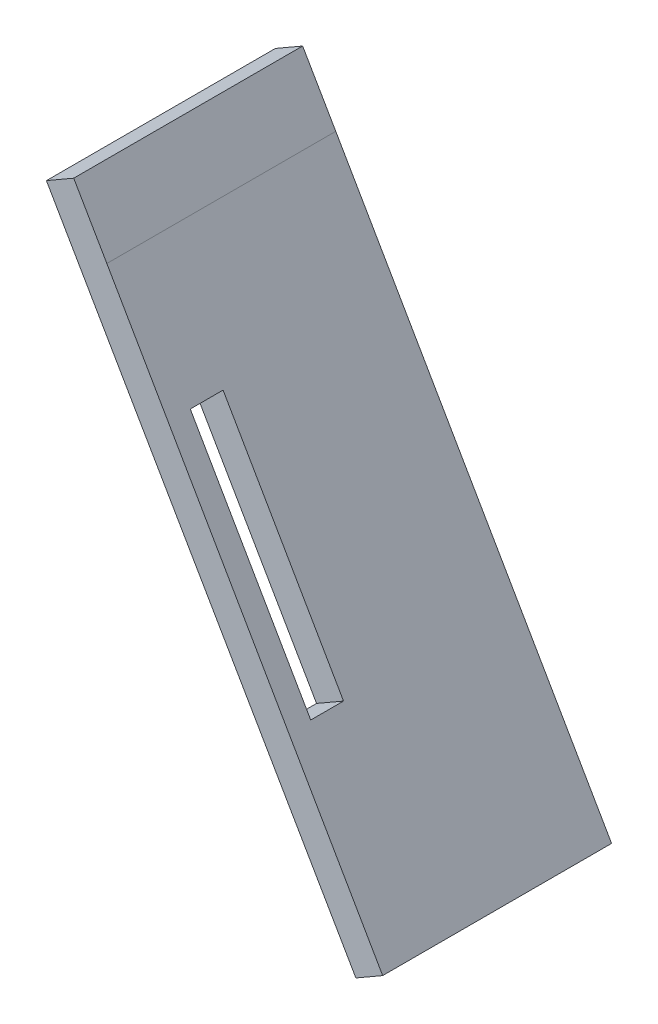
ISO-10303-21;
HEADER;
FILE_DESCRIPTION(('STEP AP214'),'2;1');
FILE_NAME('part.step','',(''),(''),'','','');
FILE_SCHEMA(('AUTOMOTIVE_DESIGN { 1 0 10303 214 1 1 1 1 }'));
ENDSEC;
DATA;
#1=APPLICATION_CONTEXT('core data for automotive mechanical design processes');
#2=APPLICATION_PROTOCOL_DEFINITION('international standard','automotive_design',2000,#1);
#3=PRODUCT_CONTEXT('',#1,'mechanical');
#4=PRODUCT('Part','Part','',(#3));
#5=PRODUCT_RELATED_PRODUCT_CATEGORY('part','',(#4));
#6=PRODUCT_DEFINITION_FORMATION('','',#4);
#7=PRODUCT_DEFINITION_CONTEXT('part definition',#1,'design');
#8=PRODUCT_DEFINITION('design','',#6,#7);
#9=PRODUCT_DEFINITION_SHAPE('','',#8);
#10=(LENGTH_UNIT() NAMED_UNIT(*) SI_UNIT(.MILLI.,.METRE.));
#11=(NAMED_UNIT(*) PLANE_ANGLE_UNIT() SI_UNIT($,.RADIAN.));
#12=(NAMED_UNIT(*) SI_UNIT($,.STERADIAN.) SOLID_ANGLE_UNIT());
#13=UNCERTAINTY_MEASURE_WITH_UNIT(LENGTH_MEASURE(1.E-05),#10,'distance_accuracy_value','');
#14=(GEOMETRIC_REPRESENTATION_CONTEXT(3) GLOBAL_UNCERTAINTY_ASSIGNED_CONTEXT((#13)) GLOBAL_UNIT_ASSIGNED_CONTEXT((#10,
#11,#12)) REPRESENTATION_CONTEXT('',''));
#15=CARTESIAN_POINT('',(0.,0.,0.));
#16=DIRECTION('',(0.,0.,1.));
#17=DIRECTION('',(1.,0.,0.));
#18=AXIS2_PLACEMENT_3D('',#15,#16,#17);
#19=CARTESIAN_POINT('',(0.,0.,0.));
#20=DIRECTION('',(0.,0.,1.));
#21=DIRECTION('',(1.,0.,0.));
#22=AXIS2_PLACEMENT_3D('',#19,#20,#21);
#23=PLANE('',#22);
#24=DIRECTION('',(-0.500301119905299,0.865851482311778,0.));
#25=VECTOR('',#24,1.);
#26=CARTESIAN_POINT('',(54.4126209077468,89.1522145456013,0.));
#27=LINE('',#26,#25);
#28=CARTESIAN_POINT('',(59.7662860214186,79.8868367760072,0.));
#29=VERTEX_POINT('',#28);
#30=CARTESIAN_POINT('',(54.4126209077468,89.1522145456013,0.));
#31=VERTEX_POINT('',#30);
#32=EDGE_CURVE('E135',#29,#31,#27,.T.);
#33=ORIENTED_EDGE('',*,*,#32,.F.);
#34=DIRECTION('',(-0.499180722761635,0.86649789729876,0.));
#35=VECTOR('',#34,1.);
#36=CARTESIAN_POINT('',(104.34763037884,2.50075317336757,0.));
#37=LINE('',#36,#35);
#38=CARTESIAN_POINT('',(104.34763037884,2.50075317336757,0.));
#39=VERTEX_POINT('',#38);
#40=EDGE_CURVE('E169',#39,#29,#37,.T.);
#41=ORIENTED_EDGE('',*,*,#40,.F.);
#42=DIRECTION('',(0.865938417345993,0.500150634673513,0.));
#43=VECTOR('',#42,1.);
#44=CARTESIAN_POINT('',(100.017938292111,0.,0.));
#45=LINE('',#44,#43);
#46=CARTESIAN_POINT('',(100.017938292111,0.,0.));
#47=VERTEX_POINT('',#46);
#48=EDGE_CURVE('E166',#47,#39,#45,.T.);
#49=ORIENTED_EDGE('',*,*,#48,.F.);
#50=DIRECTION('',(0.500150634673512,-0.865938417345993,0.));
#51=VECTOR('',#50,1.);
#52=CARTESIAN_POINT('',(55.3500000472887,77.3360685127968,0.));
#53=LINE('',#52,#51);
#54=CARTESIAN_POINT('',(55.3500000472887,77.3360685127968,0.));
#55=VERTEX_POINT('',#54);
#56=EDGE_CURVE('E163',#55,#47,#53,.T.);
#57=ORIENTED_EDGE('',*,*,#56,.F.);
#58=DIRECTION('',(0.500000000000109,-0.866025403784375,0.));
#59=VECTOR('',#58,1.);
#60=CARTESIAN_POINT('',(50.0000000283191,86.6025403661439,0.));
#61=LINE('',#60,#59);
#62=CARTESIAN_POINT('',(50.0000000283191,86.6025403661439,0.));
#63=VERTEX_POINT('',#62);
#64=EDGE_CURVE('E160',#63,#55,#61,.T.);
#65=ORIENTED_EDGE('',*,*,#64,.F.);
#66=DIRECTION('',(-0.865851482311778,-0.500301119905299,0.));
#67=VECTOR('',#66,1.);
#68=CARTESIAN_POINT('',(50.0000000283191,86.6025403661439,0.));
#69=LINE('',#68,#67);
#70=EDGE_CURVE('E157',#31,#63,#69,.T.);
#71=ORIENTED_EDGE('',*,*,#70,.F.);
#72=EDGE_LOOP('',(#33,#41,#49,#57,#65,#71));
#73=FACE_BOUND('',#72,.T.);
#74=ADVANCED_FACE('F32',(#73),#23,.F.);
#75=CARTESIAN_POINT('',(104.34763037884,2.50075317336757,141.411600328229));
#76=DIRECTION('',(-0.86649789729876,-0.499180722761635,0.));
#77=DIRECTION('',(0.499180722761635,-0.86649789729876,0.));
#78=AXIS2_PLACEMENT_3D('',#75,#76,#77);
#79=PLANE('',#78);
#80=DIRECTION('',(0.,0.,-1.));
#81=VECTOR('',#80,1.);
#82=CARTESIAN_POINT('',(89.1456745012196,28.8889172232784,0.));
#83=LINE('',#82,#81);
#84=CARTESIAN_POINT('',(89.1456745012195,28.8889172232784,33.4244095305818));
#85=VERTEX_POINT('',#84);
#86=CARTESIAN_POINT('',(89.1456745012196,28.8889172232784,28.1244095305818));
#87=VERTEX_POINT('',#86);
#88=EDGE_CURVE('E121',#85,#87,#83,.T.);
#89=ORIENTED_EDGE('',*,*,#88,.F.);
#90=DIRECTION('',(0.499180722761635,-0.86649789729876,0.));
#91=VECTOR('',#90,1.);
#92=CARTESIAN_POINT('',(79.4278157763652,45.7575657254635,33.4244095305818));
#93=LINE('',#92,#91);
#94=CARTESIAN_POINT('',(69.6776263135158,62.68233521793,33.4244095305818));
#95=VERTEX_POINT('',#94);
#96=EDGE_CURVE('E47',#95,#85,#93,.T.);
#97=ORIENTED_EDGE('',*,*,#96,.F.);
#98=DIRECTION('',(0.,0.,-1.));
#99=VECTOR('',#98,1.);
#100=CARTESIAN_POINT('',(69.6776263135158,62.68233521793,0.));
#101=LINE('',#100,#99);
#102=CARTESIAN_POINT('',(69.6776263135158,62.68233521793,28.1244095305818));
#103=VERTEX_POINT('',#102);
#104=EDGE_CURVE('E128',#95,#103,#101,.T.);
#105=ORIENTED_EDGE('',*,*,#104,.T.);
#106=DIRECTION('',(-0.499180722761635,0.86649789729876,0.));
#107=VECTOR('',#106,1.);
#108=CARTESIAN_POINT('',(79.4278157763652,45.7575657254635,28.1244095305818));
#109=LINE('',#108,#107);
#110=EDGE_CURVE('E112',#87,#103,#109,.T.);
#111=ORIENTED_EDGE('',*,*,#110,.F.);
#112=EDGE_LOOP('',(#89,#97,#105,#111));
#113=FACE_BOUND('',#112,.T.);
#114=DIRECTION('',(0.,0.,-1.));
#115=VECTOR('',#114,1.);
#116=CARTESIAN_POINT('',(59.7662860214186,79.8868367760072,141.411600328229));
#117=LINE('',#116,#115);
#118=CARTESIAN_POINT('',(59.7662860214186,79.8868367760072,37.));
#119=VERTEX_POINT('',#118);
#120=EDGE_CURVE('E172',#119,#29,#117,.T.);
#121=ORIENTED_EDGE('',*,*,#120,.F.);
#122=DIRECTION('',(0.499180722761635,-0.86649789729876,0.));
#123=VECTOR('',#122,1.);
#124=CARTESIAN_POINT('',(104.34763037884,2.50075317336756,37.));
#125=LINE('',#124,#123);
#126=CARTESIAN_POINT('',(104.34763037884,2.50075317336757,37.));
#127=VERTEX_POINT('',#126);
#128=EDGE_CURVE('E142',#119,#127,#125,.T.);
#129=ORIENTED_EDGE('',*,*,#128,.T.);
#130=DIRECTION('',(0.,0.,-1.));
#131=VECTOR('',#130,1.);
#132=CARTESIAN_POINT('',(104.34763037884,2.50075317336757,141.411600328229));
#133=LINE('',#132,#131);
#134=EDGE_CURVE('E174',#127,#39,#133,.T.);
#135=ORIENTED_EDGE('',*,*,#134,.T.);
#136=ORIENTED_EDGE('',*,*,#40,.T.);
#137=EDGE_LOOP('',(#121,#129,#135,#136));
#138=FACE_BOUND('',#137,.T.);
#139=ADVANCED_FACE('F125',(#113,#138),#79,.F.);
#140=CARTESIAN_POINT('',(100.017938292111,0.,141.411600328229));
#141=DIRECTION('',(-0.500150634673513,0.865938417345993,0.));
#142=DIRECTION('',(-0.865938417345993,-0.500150634673513,0.));
#143=AXIS2_PLACEMENT_3D('',#140,#141,#142);
#144=PLANE('',#143);
#145=ORIENTED_EDGE('',*,*,#134,.F.);
#146=DIRECTION('',(-0.865938417345993,-0.500150634673513,0.));
#147=VECTOR('',#146,1.);
#148=CARTESIAN_POINT('',(100.017938292111,0.,37.));
#149=LINE('',#148,#147);
#150=CARTESIAN_POINT('',(100.017938292111,0.,37.));
#151=VERTEX_POINT('',#150);
#152=EDGE_CURVE('E138',#127,#151,#149,.T.);
#153=ORIENTED_EDGE('',*,*,#152,.T.);
#154=DIRECTION('',(0.,0.,-1.));
#155=VECTOR('',#154,1.);
#156=CARTESIAN_POINT('',(100.017938292111,0.,141.411600328229));
#157=LINE('',#156,#155);
#158=EDGE_CURVE('E176',#151,#47,#157,.T.);
#159=ORIENTED_EDGE('',*,*,#158,.T.);
#160=ORIENTED_EDGE('',*,*,#48,.T.);
#161=EDGE_LOOP('',(#145,#153,#159,#160));
#162=FACE_BOUND('',#161,.T.);
#163=ADVANCED_FACE('F212',(#162),#144,.F.);
#164=CARTESIAN_POINT('',(55.3500000472887,77.3360685127968,141.411600328229));
#165=DIRECTION('',(0.865938417345993,0.500150634673512,0.));
#166=DIRECTION('',(-0.500150634673512,0.865938417345993,0.));
#167=AXIS2_PLACEMENT_3D('',#164,#165,#166);
#168=PLANE('',#167);
#169=DIRECTION('',(0.,0.,-1.));
#170=VECTOR('',#169,1.);
#171=CARTESIAN_POINT('',(65.2777482555798,60.1476097259577,141.411600328229));
#172=LINE('',#171,#170);
#173=CARTESIAN_POINT('',(65.2777482555798,60.1476097259577,33.4244095305818));
#174=VERTEX_POINT('',#173);
#175=CARTESIAN_POINT('',(65.2777482555798,60.1476097259577,28.1244095305818));
#176=VERTEX_POINT('',#175);
#177=EDGE_CURVE('E40',#174,#176,#172,.T.);
#178=ORIENTED_EDGE('',*,*,#177,.F.);
#179=DIRECTION('',(0.500150634673512,-0.865938417345993,0.));
#180=VECTOR('',#179,1.);
#181=CARTESIAN_POINT('',(55.3500000472887,77.3360685127968,33.4244095305818));
#182=LINE('',#181,#180);
#183=CARTESIAN_POINT('',(84.7836352355697,26.3759902789318,33.4244095305818));
#184=VERTEX_POINT('',#183);
#185=EDGE_CURVE('E11',#174,#184,#182,.T.);
#186=ORIENTED_EDGE('',*,*,#185,.T.);
#187=DIRECTION('',(0.,0.,-1.));
#188=VECTOR('',#187,1.);
#189=CARTESIAN_POINT('',(84.7836352355697,26.3759902789318,141.411600328229));
#190=LINE('',#189,#188);
#191=CARTESIAN_POINT('',(84.7836352355697,26.3759902789318,28.1244095305818));
#192=VERTEX_POINT('',#191);
#193=EDGE_CURVE('E154',#184,#192,#190,.T.);
#194=ORIENTED_EDGE('',*,*,#193,.T.);
#195=DIRECTION('',(-0.500150634673512,0.865938417345993,0.));
#196=VECTOR('',#195,1.);
#197=CARTESIAN_POINT('',(55.3500000472887,77.3360685127968,28.1244095305818));
#198=LINE('',#197,#196);
#199=EDGE_CURVE('E115',#192,#176,#198,.T.);
#200=ORIENTED_EDGE('',*,*,#199,.T.);
#201=EDGE_LOOP('',(#178,#186,#194,#200));
#202=FACE_BOUND('',#201,.T.);
#203=ORIENTED_EDGE('',*,*,#158,.F.);
#204=DIRECTION('',(-0.500150634673512,0.865938417345993,0.));
#205=VECTOR('',#204,1.);
#206=CARTESIAN_POINT('',(55.3500000472887,77.3360685127967,37.));
#207=LINE('',#206,#205);
#208=CARTESIAN_POINT('',(55.3500000472887,77.3360685127968,37.));
#209=VERTEX_POINT('',#208);
#210=EDGE_CURVE('E141',#151,#209,#207,.T.);
#211=ORIENTED_EDGE('',*,*,#210,.T.);
#212=DIRECTION('',(0.,0.,-1.));
#213=VECTOR('',#212,1.);
#214=CARTESIAN_POINT('',(55.3500000472887,77.3360685127968,141.411600328229));
#215=LINE('',#214,#213);
#216=EDGE_CURVE('E178',#209,#55,#215,.T.);
#217=ORIENTED_EDGE('',*,*,#216,.T.);
#218=ORIENTED_EDGE('',*,*,#56,.T.);
#219=EDGE_LOOP('',(#203,#211,#217,#218));
#220=FACE_BOUND('',#219,.T.);
#221=ADVANCED_FACE('F192',(#202,#220),#168,.F.);
#222=CARTESIAN_POINT('',(50.0000000283191,86.6025403661439,141.411600328229));
#223=DIRECTION('',(0.866025403784375,0.500000000000109,0.));
#224=DIRECTION('',(-0.500000000000109,0.866025403784375,0.));
#225=AXIS2_PLACEMENT_3D('',#222,#223,#224);
#226=PLANE('',#225);
#227=ORIENTED_EDGE('',*,*,#216,.F.);
#228=DIRECTION('',(-0.500000000000109,0.866025403784375,0.));
#229=VECTOR('',#228,1.);
#230=CARTESIAN_POINT('',(50.0000000283191,86.6025403661439,37.));
#231=LINE('',#230,#229);
#232=CARTESIAN_POINT('',(50.0000000283191,86.6025403661439,37.));
#233=VERTEX_POINT('',#232);
#234=EDGE_CURVE('E145',#209,#233,#231,.T.);
#235=ORIENTED_EDGE('',*,*,#234,.T.);
#236=DIRECTION('',(0.,0.,-1.));
#237=VECTOR('',#236,1.);
#238=CARTESIAN_POINT('',(50.0000000283191,86.6025403661439,141.411600328229));
#239=LINE('',#238,#237);
#240=EDGE_CURVE('E180',#233,#63,#239,.T.);
#241=ORIENTED_EDGE('',*,*,#240,.T.);
#242=ORIENTED_EDGE('',*,*,#64,.T.);
#243=EDGE_LOOP('',(#227,#235,#241,#242));
#244=FACE_BOUND('',#243,.T.);
#245=ADVANCED_FACE('F221',(#244),#226,.F.);
#246=CARTESIAN_POINT('',(50.0000000283191,86.6025403661439,141.411600328229));
#247=DIRECTION('',(0.500301119905299,-0.865851482311778,0.));
#248=DIRECTION('',(0.865851482311778,0.500301119905299,0.));
#249=AXIS2_PLACEMENT_3D('',#246,#247,#248);
#250=PLANE('',#249);
#251=ORIENTED_EDGE('',*,*,#240,.F.);
#252=DIRECTION('',(0.865851482311778,0.500301119905299,0.));
#253=VECTOR('',#252,1.);
#254=CARTESIAN_POINT('',(50.0000000283191,86.6025403661439,37.));
#255=LINE('',#254,#253);
#256=CARTESIAN_POINT('',(54.4126209077468,89.1522145456013,37.));
#257=VERTEX_POINT('',#256);
#258=EDGE_CURVE('E148',#233,#257,#255,.T.);
#259=ORIENTED_EDGE('',*,*,#258,.T.);
#260=DIRECTION('',(0.,0.,-1.));
#261=VECTOR('',#260,1.);
#262=CARTESIAN_POINT('',(54.4126209077468,89.1522145456013,141.411600328229));
#263=LINE('',#262,#261);
#264=EDGE_CURVE('E182',#257,#31,#263,.T.);
#265=ORIENTED_EDGE('',*,*,#264,.T.);
#266=ORIENTED_EDGE('',*,*,#70,.T.);
#267=EDGE_LOOP('',(#251,#259,#265,#266));
#268=FACE_BOUND('',#267,.T.);
#269=ADVANCED_FACE('F223',(#268),#250,.F.);
#270=CARTESIAN_POINT('',(54.4126209077468,89.1522145456013,141.411600328229));
#271=DIRECTION('',(-0.865851482311778,-0.500301119905299,0.));
#272=DIRECTION('',(0.500301119905299,-0.865851482311778,0.));
#273=AXIS2_PLACEMENT_3D('',#270,#271,#272);
#274=PLANE('',#273);
#275=ORIENTED_EDGE('',*,*,#264,.F.);
#276=DIRECTION('',(0.500301119905299,-0.865851482311778,0.));
#277=VECTOR('',#276,1.);
#278=CARTESIAN_POINT('',(54.4126209077468,89.1522145456013,37.));
#279=LINE('',#278,#277);
#280=EDGE_CURVE('E151',#257,#119,#279,.T.);
#281=ORIENTED_EDGE('',*,*,#280,.T.);
#282=ORIENTED_EDGE('',*,*,#120,.T.);
#283=ORIENTED_EDGE('',*,*,#32,.T.);
#284=EDGE_LOOP('',(#275,#281,#282,#283));
#285=FACE_BOUND('',#284,.T.);
#286=ADVANCED_FACE('F34',(#285),#274,.F.);
#287=CARTESIAN_POINT('',(-47.4999999162171,-82.2724134038411,37.));
#288=DIRECTION('',(0.,0.,-1.));
#289=DIRECTION('',(-3.37068095657145E-10,1.,0.));
#290=AXIS2_PLACEMENT_3D('',#287,#288,#289);
#291=PLANE('',#290);
#292=ORIENTED_EDGE('',*,*,#258,.F.);
#293=ORIENTED_EDGE('',*,*,#234,.F.);
#294=ORIENTED_EDGE('',*,*,#210,.F.);
#295=ORIENTED_EDGE('',*,*,#152,.F.);
#296=ORIENTED_EDGE('',*,*,#128,.F.);
#297=ORIENTED_EDGE('',*,*,#280,.F.);
#298=EDGE_LOOP('',(#292,#293,#294,#295,#296,#297));
#299=FACE_BOUND('',#298,.T.);
#300=ADVANCED_FACE('F196',(#299),#291,.F.);
#301=CARTESIAN_POINT('',(70.7628368033776,40.7657584978472,33.4244095305818));
#302=DIRECTION('',(0.,0.,1.));
#303=DIRECTION('',(0.,-1.,0.));
#304=AXIS2_PLACEMENT_3D('',#301,#302,#303);
#305=PLANE('',#304);
#306=DIRECTION('',(0.86649789729876,0.499180722761635,0.));
#307=VECTOR('',#306,1.);
#308=CARTESIAN_POINT('',(61.0126473405282,57.6905279903137,33.4244095305818));
#309=LINE('',#308,#307);
#310=EDGE_CURVE('E133',#174,#95,#309,.T.);
#311=ORIENTED_EDGE('',*,*,#310,.T.);
#312=ORIENTED_EDGE('',*,*,#96,.T.);
#313=DIRECTION('',(0.86649789729876,0.499180722761635,0.));
#314=VECTOR('',#313,1.);
#315=CARTESIAN_POINT('',(80.480695528232,23.897109995662,33.4244095305818));
#316=LINE('',#315,#314);
#317=EDGE_CURVE('E118',#184,#85,#316,.T.);
#318=ORIENTED_EDGE('',*,*,#317,.F.);
#319=ORIENTED_EDGE('',*,*,#185,.F.);
#320=EDGE_LOOP('',(#311,#312,#318,#319));
#321=FACE_BOUND('',#320,.T.);
#322=ADVANCED_FACE('F194',(#321),#305,.F.);
#323=CARTESIAN_POINT('',(61.0126473405282,57.6905279903137,0.));
#324=DIRECTION('',(0.499180722761635,-0.86649789729876,0.));
#325=DIRECTION('',(0.866497897298759,0.499180722761635,0.));
#326=AXIS2_PLACEMENT_3D('',#323,#324,#325);
#327=PLANE('',#326);
#328=ORIENTED_EDGE('',*,*,#177,.T.);
#329=DIRECTION('',(0.86649789729876,0.499180722761635,0.));
#330=VECTOR('',#329,1.);
#331=CARTESIAN_POINT('',(61.0126473405282,57.6905279903137,28.1244095305818));
#332=LINE('',#331,#330);
#333=EDGE_CURVE('E117',#176,#103,#332,.T.);
#334=ORIENTED_EDGE('',*,*,#333,.T.);
#335=ORIENTED_EDGE('',*,*,#104,.F.);
#336=ORIENTED_EDGE('',*,*,#310,.F.);
#337=EDGE_LOOP('',(#328,#334,#335,#336));
#338=FACE_BOUND('',#337,.T.);
#339=ADVANCED_FACE('F190',(#338),#327,.T.);
#340=CARTESIAN_POINT('',(70.7628368033776,40.7657584978472,28.1244095305818));
#341=DIRECTION('',(0.,0.,-1.));
#342=DIRECTION('',(-1.,0.,0.));
#343=AXIS2_PLACEMENT_3D('',#340,#341,#342);
#344=PLANE('',#343);
#345=DIRECTION('',(0.86649789729876,0.499180722761635,0.));
#346=VECTOR('',#345,1.);
#347=CARTESIAN_POINT('',(80.480695528232,23.897109995662,28.1244095305818));
#348=LINE('',#347,#346);
#349=EDGE_CURVE('E55',#192,#87,#348,.T.);
#350=ORIENTED_EDGE('',*,*,#349,.T.);
#351=ORIENTED_EDGE('',*,*,#110,.T.);
#352=ORIENTED_EDGE('',*,*,#333,.F.);
#353=ORIENTED_EDGE('',*,*,#199,.F.);
#354=EDGE_LOOP('',(#350,#351,#352,#353));
#355=FACE_BOUND('',#354,.T.);
#356=ADVANCED_FACE('F109',(#355),#344,.F.);
#357=CARTESIAN_POINT('',(80.480695528232,23.897109995662,0.));
#358=DIRECTION('',(0.499180722761635,-0.86649789729876,0.));
#359=DIRECTION('',(0.866497897298759,0.499180722761635,0.));
#360=AXIS2_PLACEMENT_3D('',#357,#358,#359);
#361=PLANE('',#360);
#362=ORIENTED_EDGE('',*,*,#317,.T.);
#363=ORIENTED_EDGE('',*,*,#88,.T.);
#364=ORIENTED_EDGE('',*,*,#349,.F.);
#365=ORIENTED_EDGE('',*,*,#193,.F.);
#366=EDGE_LOOP('',(#362,#363,#364,#365));
#367=FACE_BOUND('',#366,.T.);
#368=ADVANCED_FACE('F122',(#367),#361,.F.);
#369=CLOSED_SHELL('',(#74,#139,#163,#221,#245,#269,#286,#300,#322,#339,#356,#368));
#370=MANIFOLD_SOLID_BREP('B2',#369);
#371=ADVANCED_BREP_SHAPE_REPRESENTATION('',(#18,#370),#14);
#372=SHAPE_DEFINITION_REPRESENTATION(#9,#371);
ENDSEC;
END-ISO-10303-21;
